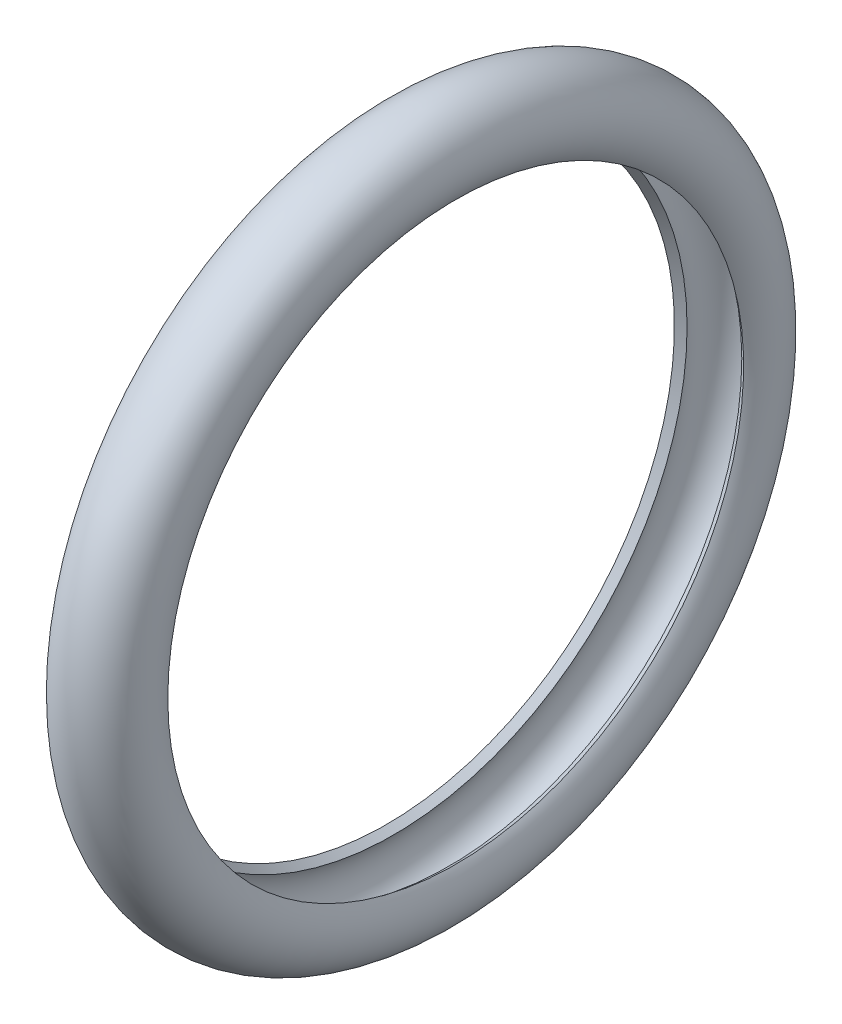
ISO-10303-21;
HEADER;
FILE_DESCRIPTION(('STEP AP214'),'2;1');
FILE_NAME('part.step','',(''),(''),'','','');
FILE_SCHEMA(('AUTOMOTIVE_DESIGN { 1 0 10303 214 1 1 1 1 }'));
ENDSEC;
DATA;
#1=APPLICATION_CONTEXT('core data for automotive mechanical design processes');
#2=APPLICATION_PROTOCOL_DEFINITION('international standard','automotive_design',2000,#1);
#3=PRODUCT_CONTEXT('',#1,'mechanical');
#4=PRODUCT('Part','Part','',(#3));
#5=PRODUCT_RELATED_PRODUCT_CATEGORY('part','',(#4));
#6=PRODUCT_DEFINITION_FORMATION('','',#4);
#7=PRODUCT_DEFINITION_CONTEXT('part definition',#1,'design');
#8=PRODUCT_DEFINITION('design','',#6,#7);
#9=PRODUCT_DEFINITION_SHAPE('','',#8);
#10=(LENGTH_UNIT() NAMED_UNIT(*) SI_UNIT(.MILLI.,.METRE.));
#11=(NAMED_UNIT(*) PLANE_ANGLE_UNIT() SI_UNIT($,.RADIAN.));
#12=(NAMED_UNIT(*) SI_UNIT($,.STERADIAN.) SOLID_ANGLE_UNIT());
#13=UNCERTAINTY_MEASURE_WITH_UNIT(LENGTH_MEASURE(1.E-05),#10,'distance_accuracy_value','');
#14=(GEOMETRIC_REPRESENTATION_CONTEXT(3) GLOBAL_UNCERTAINTY_ASSIGNED_CONTEXT((#13)) GLOBAL_UNIT_ASSIGNED_CONTEXT((#10,
#11,#12)) REPRESENTATION_CONTEXT('',''));
#15=CARTESIAN_POINT('',(0.,0.,0.));
#16=DIRECTION('',(0.,0.,1.));
#17=DIRECTION('',(1.,0.,0.));
#18=AXIS2_PLACEMENT_3D('',#15,#16,#17);
#19=CARTESIAN_POINT('',(2.08722353556157,0.,0.));
#20=DIRECTION('',(-1.,0.,0.));
#21=DIRECTION('',(0.,0.,1.));
#22=AXIS2_PLACEMENT_3D('',#19,#20,#21);
#23=TOROIDAL_SURFACE('',#22,8.685,1.195);
#24=CARTESIAN_POINT('',(1.1297267992747,0.,0.));
#25=DIRECTION('',(-1.,0.,0.));
#26=DIRECTION('',(0.,0.,1.));
#27=AXIS2_PLACEMENT_3D('',#24,#25,#26);
#28=CIRCLE('',#27,7.97);
#29=CARTESIAN_POINT('',(1.1297267992747,0.,7.97));
#30=VERTEX_POINT('',#29);
#31=EDGE_CURVE('E10',#30,#30,#28,.T.);
#32=ORIENTED_EDGE('',*,*,#31,.F.);
#33=EDGE_LOOP('',(#32));
#34=FACE_BOUND('',#33,.T.);
#35=CARTESIAN_POINT('',(3.04472027184843,0.,0.));
#36=DIRECTION('',(-1.,0.,0.));
#37=DIRECTION('',(0.,0.,1.));
#38=AXIS2_PLACEMENT_3D('',#35,#36,#37);
#39=CIRCLE('',#38,7.97);
#40=CARTESIAN_POINT('',(3.04472027184843,0.,7.97));
#41=VERTEX_POINT('',#40);
#42=EDGE_CURVE('E49',#41,#41,#39,.T.);
#43=ORIENTED_EDGE('',*,*,#42,.T.);
#44=EDGE_LOOP('',(#43));
#45=FACE_BOUND('',#44,.T.);
#46=ADVANCED_FACE('F35',(#34,#45),#23,.T.);
#47=CARTESIAN_POINT('',(1.1297267992747,0.,0.));
#48=DIRECTION('',(1.,0.,0.));
#49=DIRECTION('',(0.,0.,-1.));
#50=AXIS2_PLACEMENT_3D('',#47,#48,#49);
#51=CONICAL_SURFACE('',#50,7.97,0.641410695746036);
#52=CARTESIAN_POINT('',(1.33003992402091,0.,0.));
#53=DIRECTION('',(-1.,0.,0.));
#54=DIRECTION('',(0.,0.,1.));
#55=AXIS2_PLACEMENT_3D('',#52,#53,#54);
#56=CIRCLE('',#55,8.11958158995816);
#57=CARTESIAN_POINT('',(1.33003992402091,0.,8.11958158995816));
#58=VERTEX_POINT('',#57);
#59=EDGE_CURVE('E41',#58,#58,#56,.T.);
#60=ORIENTED_EDGE('',*,*,#59,.F.);
#61=EDGE_LOOP('',(#60));
#62=FACE_BOUND('',#61,.T.);
#63=ORIENTED_EDGE('',*,*,#31,.T.);
#64=EDGE_LOOP('',(#63));
#65=FACE_BOUND('',#64,.T.);
#66=ADVANCED_FACE('F64',(#62,#65),#51,.F.);
#67=CARTESIAN_POINT('',(2.08722353556157,0.,0.));
#68=DIRECTION('',(-1.,0.,0.));
#69=DIRECTION('',(0.,0.,1.));
#70=AXIS2_PLACEMENT_3D('',#67,#68,#69);
#71=TOROIDAL_SURFACE('',#70,8.685,0.945);
#72=CARTESIAN_POINT('',(2.84440714710224,0.,0.));
#73=DIRECTION('',(-1.,0.,0.));
#74=DIRECTION('',(0.,0.,1.));
#75=AXIS2_PLACEMENT_3D('',#72,#73,#74);
#76=CIRCLE('',#75,8.11958158995816);
#77=CARTESIAN_POINT('',(2.84440714710224,0.,8.11958158995816));
#78=VERTEX_POINT('',#77);
#79=EDGE_CURVE('E45',#78,#78,#76,.T.);
#80=ORIENTED_EDGE('',*,*,#79,.F.);
#81=EDGE_LOOP('',(#80));
#82=FACE_BOUND('',#81,.T.);
#83=ORIENTED_EDGE('',*,*,#59,.T.);
#84=EDGE_LOOP('',(#83));
#85=FACE_BOUND('',#84,.T.);
#86=ADVANCED_FACE('F59',(#82,#85),#71,.F.);
#87=CARTESIAN_POINT('',(2.84440714710224,0.,0.));
#88=DIRECTION('',(-1.,0.,0.));
#89=DIRECTION('',(0.,0.,1.));
#90=AXIS2_PLACEMENT_3D('',#87,#88,#89);
#91=CONICAL_SURFACE('',#90,8.11958158995816,0.641410695746075);
#92=ORIENTED_EDGE('',*,*,#42,.F.);
#93=EDGE_LOOP('',(#92));
#94=FACE_BOUND('',#93,.T.);
#95=ORIENTED_EDGE('',*,*,#79,.T.);
#96=EDGE_LOOP('',(#95));
#97=FACE_BOUND('',#96,.T.);
#98=ADVANCED_FACE('F56',(#94,#97),#91,.F.);
#99=CLOSED_SHELL('',(#46,#66,#86,#98));
#100=MANIFOLD_SOLID_BREP('B2',#99);
#101=ADVANCED_BREP_SHAPE_REPRESENTATION('',(#18,#100),#14);
#102=SHAPE_DEFINITION_REPRESENTATION(#9,#101);
ENDSEC;
END-ISO-10303-21;
